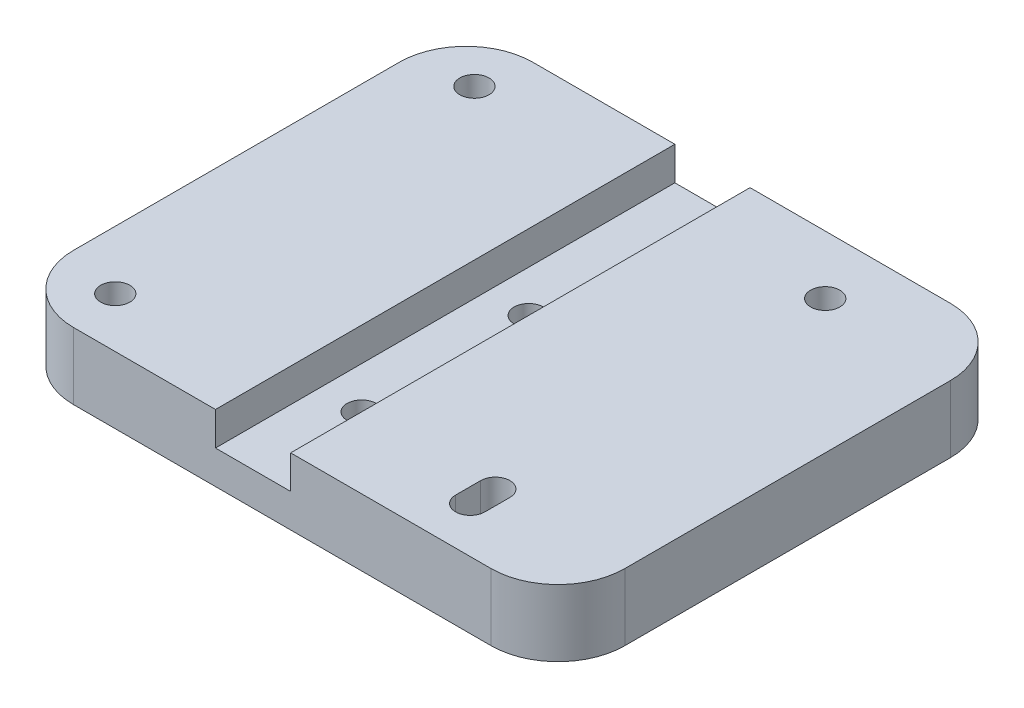
ISO-10303-21;
HEADER;
FILE_DESCRIPTION(('STEP AP214'),'2;1');
FILE_NAME('part.step','',(''),(''),'','','');
FILE_SCHEMA(('AUTOMOTIVE_DESIGN { 1 0 10303 214 1 1 1 1 }'));
ENDSEC;
DATA;
#1=APPLICATION_CONTEXT('core data for automotive mechanical design processes');
#2=APPLICATION_PROTOCOL_DEFINITION('international standard','automotive_design',2000,#1);
#3=PRODUCT_CONTEXT('',#1,'mechanical');
#4=PRODUCT('Part','Part','',(#3));
#5=PRODUCT_RELATED_PRODUCT_CATEGORY('part','',(#4));
#6=PRODUCT_DEFINITION_FORMATION('','',#4);
#7=PRODUCT_DEFINITION_CONTEXT('part definition',#1,'design');
#8=PRODUCT_DEFINITION('design','',#6,#7);
#9=PRODUCT_DEFINITION_SHAPE('','',#8);
#10=(LENGTH_UNIT() NAMED_UNIT(*) SI_UNIT(.MILLI.,.METRE.));
#11=(NAMED_UNIT(*) PLANE_ANGLE_UNIT() SI_UNIT($,.RADIAN.));
#12=(NAMED_UNIT(*) SI_UNIT($,.STERADIAN.) SOLID_ANGLE_UNIT());
#13=UNCERTAINTY_MEASURE_WITH_UNIT(LENGTH_MEASURE(1.E-05),#10,'distance_accuracy_value','');
#14=(GEOMETRIC_REPRESENTATION_CONTEXT(3) GLOBAL_UNCERTAINTY_ASSIGNED_CONTEXT((#13)) GLOBAL_UNIT_ASSIGNED_CONTEXT((#10,
#11,#12)) REPRESENTATION_CONTEXT('',''));
#15=CARTESIAN_POINT('',(0.,0.,0.));
#16=DIRECTION('',(0.,0.,1.));
#17=DIRECTION('',(1.,0.,0.));
#18=AXIS2_PLACEMENT_3D('',#15,#16,#17);
#19=CARTESIAN_POINT('',(50.,4.,49.5));
#20=DIRECTION('',(0.,-1.,0.));
#21=DIRECTION('',(0.,0.,-1.));
#22=AXIS2_PLACEMENT_3D('',#19,#20,#21);
#23=CYLINDRICAL_SURFACE('',#22,1.75);
#24=CARTESIAN_POINT('',(50.,4.,49.5));
#25=DIRECTION('',(0.,-1.,0.));
#26=DIRECTION('',(0.,0.,-1.));
#27=AXIS2_PLACEMENT_3D('',#24,#25,#26);
#28=CIRCLE('',#27,1.75);
#29=CARTESIAN_POINT('',(48.25,4.,49.5));
#30=VERTEX_POINT('',#29);
#31=CARTESIAN_POINT('',(51.75,4.,49.5));
#32=VERTEX_POINT('',#31);
#33=EDGE_CURVE('E222',#30,#32,#28,.F.);
#34=ORIENTED_EDGE('',*,*,#33,.F.);
#35=DIRECTION('',(0.,-1.,0.));
#36=VECTOR('',#35,1.);
#37=CARTESIAN_POINT('',(48.25,4.,49.5));
#38=LINE('',#37,#36);
#39=CARTESIAN_POINT('',(48.25,8.,49.5));
#40=VERTEX_POINT('',#39);
#41=EDGE_CURVE('E306',#40,#30,#38,.T.);
#42=ORIENTED_EDGE('',*,*,#41,.F.);
#43=CARTESIAN_POINT('',(50.,8.,49.5));
#44=DIRECTION('',(0.,1.,0.));
#45=DIRECTION('',(-1.,0.,0.));
#46=AXIS2_PLACEMENT_3D('',#43,#44,#45);
#47=CIRCLE('',#46,1.75);
#48=CARTESIAN_POINT('',(51.75,8.,49.5));
#49=VERTEX_POINT('',#48);
#50=EDGE_CURVE('E258',#40,#49,#47,.T.);
#51=ORIENTED_EDGE('',*,*,#50,.T.);
#52=DIRECTION('',(0.,-1.,0.));
#53=VECTOR('',#52,1.);
#54=CARTESIAN_POINT('',(51.75,4.,49.5));
#55=LINE('',#54,#53);
#56=EDGE_CURVE('E296',#49,#32,#55,.T.);
#57=ORIENTED_EDGE('',*,*,#56,.T.);
#58=EDGE_LOOP('',(#34,#42,#51,#57));
#59=FACE_BOUND('',#58,.T.);
#60=ADVANCED_FACE('F33',(#59),#23,.F.);
#61=CARTESIAN_POINT('',(51.75,4.,49.5));
#62=DIRECTION('',(1.,0.,0.));
#63=DIRECTION('',(0.,0.,-1.));
#64=AXIS2_PLACEMENT_3D('',#61,#62,#63);
#65=PLANE('',#64);
#66=DIRECTION('',(0.,0.,-1.));
#67=VECTOR('',#66,1.);
#68=CARTESIAN_POINT('',(51.75,4.,49.5));
#69=LINE('',#68,#67);
#70=CARTESIAN_POINT('',(51.75,4.,46.5));
#71=VERTEX_POINT('',#70);
#72=EDGE_CURVE('E219',#32,#71,#69,.T.);
#73=ORIENTED_EDGE('',*,*,#72,.F.);
#74=ORIENTED_EDGE('',*,*,#56,.F.);
#75=DIRECTION('',(0.,0.,-1.));
#76=VECTOR('',#75,1.);
#77=CARTESIAN_POINT('',(51.75,8.,46.5));
#78=LINE('',#77,#76);
#79=CARTESIAN_POINT('',(51.75,8.,46.5));
#80=VERTEX_POINT('',#79);
#81=EDGE_CURVE('E261',#49,#80,#78,.T.);
#82=ORIENTED_EDGE('',*,*,#81,.T.);
#83=DIRECTION('',(0.,-1.,0.));
#84=VECTOR('',#83,1.);
#85=CARTESIAN_POINT('',(51.75,4.,46.5));
#86=LINE('',#85,#84);
#87=EDGE_CURVE('E300',#80,#71,#86,.T.);
#88=ORIENTED_EDGE('',*,*,#87,.T.);
#89=EDGE_LOOP('',(#73,#74,#82,#88));
#90=FACE_BOUND('',#89,.T.);
#91=ADVANCED_FACE('F445',(#90),#65,.F.);
#92=CARTESIAN_POINT('',(50.,4.,46.5));
#93=DIRECTION('',(0.,-1.,0.));
#94=DIRECTION('',(0.,0.,-1.));
#95=AXIS2_PLACEMENT_3D('',#92,#93,#94);
#96=CYLINDRICAL_SURFACE('',#95,1.75);
#97=CARTESIAN_POINT('',(50.,4.,46.5));
#98=DIRECTION('',(0.,-1.,0.));
#99=DIRECTION('',(0.,0.,-1.));
#100=AXIS2_PLACEMENT_3D('',#97,#98,#99);
#101=CIRCLE('',#100,1.75);
#102=CARTESIAN_POINT('',(48.25,4.,46.5));
#103=VERTEX_POINT('',#102);
#104=EDGE_CURVE('E217',#71,#103,#101,.F.);
#105=ORIENTED_EDGE('',*,*,#104,.F.);
#106=ORIENTED_EDGE('',*,*,#87,.F.);
#107=CARTESIAN_POINT('',(50.,8.,46.5));
#108=DIRECTION('',(0.,1.,0.));
#109=DIRECTION('',(-1.,0.,0.));
#110=AXIS2_PLACEMENT_3D('',#107,#108,#109);
#111=CIRCLE('',#110,1.75);
#112=CARTESIAN_POINT('',(48.25,7.99999999999999,46.5));
#113=VERTEX_POINT('',#112);
#114=EDGE_CURVE('E264',#80,#113,#111,.T.);
#115=ORIENTED_EDGE('',*,*,#114,.T.);
#116=DIRECTION('',(0.,-1.,0.));
#117=VECTOR('',#116,1.);
#118=CARTESIAN_POINT('',(48.25,4.,46.5));
#119=LINE('',#118,#117);
#120=EDGE_CURVE('E303',#113,#103,#119,.T.);
#121=ORIENTED_EDGE('',*,*,#120,.T.);
#122=EDGE_LOOP('',(#105,#106,#115,#121));
#123=FACE_BOUND('',#122,.T.);
#124=ADVANCED_FACE('F450',(#123),#96,.F.);
#125=CARTESIAN_POINT('',(48.25,4.,49.5));
#126=DIRECTION('',(-1.,0.,0.));
#127=DIRECTION('',(0.,0.,1.));
#128=AXIS2_PLACEMENT_3D('',#125,#126,#127);
#129=PLANE('',#128);
#130=DIRECTION('',(0.,0.,1.));
#131=VECTOR('',#130,1.);
#132=CARTESIAN_POINT('',(48.25,4.,49.5));
#133=LINE('',#132,#131);
#134=EDGE_CURVE('E327',#103,#30,#133,.T.);
#135=ORIENTED_EDGE('',*,*,#134,.F.);
#136=ORIENTED_EDGE('',*,*,#120,.F.);
#137=DIRECTION('',(0.,0.,1.));
#138=VECTOR('',#137,1.);
#139=CARTESIAN_POINT('',(48.25,8.,49.5));
#140=LINE('',#139,#138);
#141=EDGE_CURVE('E267',#113,#40,#140,.T.);
#142=ORIENTED_EDGE('',*,*,#141,.T.);
#143=ORIENTED_EDGE('',*,*,#41,.T.);
#144=EDGE_LOOP('',(#135,#136,#142,#143));
#145=FACE_BOUND('',#144,.T.);
#146=ADVANCED_FACE('F455',(#145),#129,.F.);
#147=CARTESIAN_POINT('',(7.,4.,49.));
#148=DIRECTION('',(0.,-1.,0.));
#149=DIRECTION('',(0.,0.,-1.));
#150=AXIS2_PLACEMENT_3D('',#147,#148,#149);
#151=CYLINDRICAL_SURFACE('',#150,1.75000000000001);
#152=CARTESIAN_POINT('',(7.,8.,49.));
#153=DIRECTION('',(0.,1.,0.));
#154=DIRECTION('',(-1.,0.,0.));
#155=AXIS2_PLACEMENT_3D('',#152,#153,#154);
#156=CIRCLE('',#155,1.75000000000001);
#157=CARTESIAN_POINT('',(5.24999999999999,8.,49.));
#158=VERTEX_POINT('',#157);
#159=EDGE_CURVE('E234',#158,#158,#156,.T.);
#160=ORIENTED_EDGE('',*,*,#159,.T.);
#161=EDGE_LOOP('',(#160));
#162=FACE_BOUND('',#161,.T.);
#163=CARTESIAN_POINT('',(7.,4.,49.));
#164=DIRECTION('',(0.,-1.,0.));
#165=DIRECTION('',(0.,0.,-1.));
#166=AXIS2_PLACEMENT_3D('',#163,#164,#165);
#167=CIRCLE('',#166,1.75000000000001);
#168=CARTESIAN_POINT('',(7.,4.,47.25));
#169=VERTEX_POINT('',#168);
#170=EDGE_CURVE('E220',#169,#169,#167,.F.);
#171=ORIENTED_EDGE('',*,*,#170,.F.);
#172=EDGE_LOOP('',(#171));
#173=FACE_BOUND('',#172,.T.);
#174=ADVANCED_FACE('F458',(#162,#173),#151,.F.);
#175=CARTESIAN_POINT('',(7.,4.,6.));
#176=DIRECTION('',(0.,-1.,0.));
#177=DIRECTION('',(0.,0.,-1.));
#178=AXIS2_PLACEMENT_3D('',#175,#176,#177);
#179=CYLINDRICAL_SURFACE('',#178,1.75);
#180=CARTESIAN_POINT('',(7.,8.,6.));
#181=DIRECTION('',(0.,1.,0.));
#182=DIRECTION('',(-1.,0.,0.));
#183=AXIS2_PLACEMENT_3D('',#180,#181,#182);
#184=CIRCLE('',#183,1.75);
#185=CARTESIAN_POINT('',(5.24999999999999,8.,6.));
#186=VERTEX_POINT('',#185);
#187=EDGE_CURVE('E231',#186,#186,#184,.T.);
#188=ORIENTED_EDGE('',*,*,#187,.T.);
#189=EDGE_LOOP('',(#188));
#190=FACE_BOUND('',#189,.T.);
#191=CARTESIAN_POINT('',(7.,4.,6.));
#192=DIRECTION('',(0.,-1.,0.));
#193=DIRECTION('',(0.,0.,-1.));
#194=AXIS2_PLACEMENT_3D('',#191,#192,#193);
#195=CIRCLE('',#194,1.75);
#196=CARTESIAN_POINT('',(7.,4.,4.25));
#197=VERTEX_POINT('',#196);
#198=EDGE_CURVE('E330',#197,#197,#195,.F.);
#199=ORIENTED_EDGE('',*,*,#198,.F.);
#200=EDGE_LOOP('',(#199));
#201=FACE_BOUND('',#200,.T.);
#202=ADVANCED_FACE('F463',(#190,#201),#179,.F.);
#203=CARTESIAN_POINT('',(50.,4.,7.));
#204=DIRECTION('',(0.,-1.,0.));
#205=DIRECTION('',(0.,0.,-1.));
#206=AXIS2_PLACEMENT_3D('',#203,#204,#205);
#207=CYLINDRICAL_SURFACE('',#206,1.75);
#208=CARTESIAN_POINT('',(50.,8.,7.));
#209=DIRECTION('',(0.,1.,0.));
#210=DIRECTION('',(-1.,0.,0.));
#211=AXIS2_PLACEMENT_3D('',#208,#209,#210);
#212=CIRCLE('',#211,1.75);
#213=CARTESIAN_POINT('',(48.25,8.,7.));
#214=VERTEX_POINT('',#213);
#215=EDGE_CURVE('E255',#214,#214,#212,.T.);
#216=ORIENTED_EDGE('',*,*,#215,.T.);
#217=EDGE_LOOP('',(#216));
#218=FACE_BOUND('',#217,.T.);
#219=CARTESIAN_POINT('',(50.,4.,7.));
#220=DIRECTION('',(0.,-1.,0.));
#221=DIRECTION('',(0.,0.,-1.));
#222=AXIS2_PLACEMENT_3D('',#219,#220,#221);
#223=CIRCLE('',#222,1.75);
#224=CARTESIAN_POINT('',(50.,4.,5.25));
#225=VERTEX_POINT('',#224);
#226=EDGE_CURVE('E228',#225,#225,#223,.F.);
#227=ORIENTED_EDGE('',*,*,#226,.F.);
#228=EDGE_LOOP('',(#227));
#229=FACE_BOUND('',#228,.T.);
#230=ADVANCED_FACE('F466',(#218,#229),#207,.F.);
#231=CARTESIAN_POINT('',(75.,3.99999999999999,55.));
#232=DIRECTION('',(0.,-1.,0.));
#233=DIRECTION('',(1.,0.,0.));
#234=AXIS2_PLACEMENT_3D('',#231,#232,#233);
#235=PLANE('',#234);
#236=CARTESIAN_POINT('',(30.,4.,42.5));
#237=DIRECTION('',(0.,-1.,0.));
#238=DIRECTION('',(0.,0.,1.));
#239=AXIS2_PLACEMENT_3D('',#236,#237,#238);
#240=CIRCLE('',#239,1.75);
#241=CARTESIAN_POINT('',(30.,4.,44.25));
#242=VERTEX_POINT('',#241);
#243=EDGE_CURVE('E290',#242,#242,#240,.T.);
#244=ORIENTED_EDGE('',*,*,#243,.T.);
#245=EDGE_LOOP('',(#244));
#246=FACE_BOUND('',#245,.T.);
#247=CARTESIAN_POINT('',(30.,4.,22.5));
#248=DIRECTION('',(0.,-1.,0.));
#249=DIRECTION('',(0.,0.,1.));
#250=AXIS2_PLACEMENT_3D('',#247,#248,#249);
#251=CIRCLE('',#250,1.75000000000001);
#252=CARTESIAN_POINT('',(30.,4.,24.25));
#253=VERTEX_POINT('',#252);
#254=EDGE_CURVE('E309',#253,#253,#251,.T.);
#255=ORIENTED_EDGE('',*,*,#254,.T.);
#256=EDGE_LOOP('',(#255));
#257=FACE_BOUND('',#256,.T.);
#258=DIRECTION('',(0.,0.,-1.));
#259=VECTOR('',#258,1.);
#260=CARTESIAN_POINT('',(25.,4.,55.));
#261=LINE('',#260,#259);
#262=CARTESIAN_POINT('',(25.,4.,55.));
#263=VERTEX_POINT('',#262);
#264=CARTESIAN_POINT('',(25.,4.,0.));
#265=VERTEX_POINT('',#264);
#266=EDGE_CURVE('E237',#263,#265,#261,.T.);
#267=ORIENTED_EDGE('',*,*,#266,.F.);
#268=DIRECTION('',(-1.,0.,0.));
#269=VECTOR('',#268,1.);
#270=CARTESIAN_POINT('',(75.,3.99999999999999,55.));
#271=LINE('',#270,#269);
#272=CARTESIAN_POINT('',(34.,4.,55.));
#273=VERTEX_POINT('',#272);
#274=EDGE_CURVE('E317',#273,#263,#271,.T.);
#275=ORIENTED_EDGE('',*,*,#274,.F.);
#276=DIRECTION('',(0.,0.,1.));
#277=VECTOR('',#276,1.);
#278=CARTESIAN_POINT('',(34.,4.,55.));
#279=LINE('',#278,#277);
#280=CARTESIAN_POINT('',(34.,4.,0.));
#281=VERTEX_POINT('',#280);
#282=EDGE_CURVE('E270',#281,#273,#279,.T.);
#283=ORIENTED_EDGE('',*,*,#282,.F.);
#284=DIRECTION('',(-1.,0.,0.));
#285=VECTOR('',#284,1.);
#286=CARTESIAN_POINT('',(75.,3.99999999999999,0.));
#287=LINE('',#286,#285);
#288=EDGE_CURVE('E318',#281,#265,#287,.T.);
#289=ORIENTED_EDGE('',*,*,#288,.T.);
#290=EDGE_LOOP('',(#267,#275,#283,#289));
#291=FACE_BOUND('',#290,.T.);
#292=ADVANCED_FACE('F688',(#246,#257,#291),#235,.F.);
#293=CARTESIAN_POINT('',(0.,0.,55.));
#294=DIRECTION('',(1.,0.,0.));
#295=DIRECTION('',(0.,0.,-1.));
#296=AXIS2_PLACEMENT_3D('',#293,#294,#295);
#297=PLANE('',#296);
#298=DIRECTION('',(0.,0.,1.));
#299=VECTOR('',#298,1.);
#300=CARTESIAN_POINT('',(0.,8.,55.));
#301=LINE('',#300,#299);
#302=CARTESIAN_POINT('',(0.,8.,8.));
#303=VERTEX_POINT('',#302);
#304=CARTESIAN_POINT('',(0.,8.,47.));
#305=VERTEX_POINT('',#304);
#306=EDGE_CURVE('E243',#303,#305,#301,.T.);
#307=ORIENTED_EDGE('',*,*,#306,.F.);
#308=DIRECTION('',(0.,-1.,0.));
#309=VECTOR('',#308,1.);
#310=CARTESIAN_POINT('',(0.,0.,8.));
#311=LINE('',#310,#309);
#312=CARTESIAN_POINT('',(0.,0.,8.));
#313=VERTEX_POINT('',#312);
#314=EDGE_CURVE('E365',#303,#313,#311,.T.);
#315=ORIENTED_EDGE('',*,*,#314,.T.);
#316=DIRECTION('',(0.,0.,-1.));
#317=VECTOR('',#316,1.);
#318=CARTESIAN_POINT('',(0.,0.,55.));
#319=LINE('',#318,#317);
#320=CARTESIAN_POINT('',(0.,0.,47.));
#321=VERTEX_POINT('',#320);
#322=EDGE_CURVE('E321',#321,#313,#319,.T.);
#323=ORIENTED_EDGE('',*,*,#322,.F.);
#324=DIRECTION('',(0.,-1.,0.));
#325=VECTOR('',#324,1.);
#326=CARTESIAN_POINT('',(0.,8.,47.));
#327=LINE('',#326,#325);
#328=EDGE_CURVE('E48',#321,#305,#327,.F.);
#329=ORIENTED_EDGE('',*,*,#328,.T.);
#330=EDGE_LOOP('',(#307,#315,#323,#329));
#331=FACE_BOUND('',#330,.T.);
#332=ADVANCED_FACE('F380',(#331),#297,.F.);
#333=CARTESIAN_POINT('',(0.,0.,55.));
#334=DIRECTION('',(0.,1.,0.));
#335=DIRECTION('',(0.,0.,1.));
#336=AXIS2_PLACEMENT_3D('',#333,#334,#335);
#337=PLANE('',#336);
#338=CARTESIAN_POINT('',(7.,0.,6.));
#339=DIRECTION('',(0.,-1.,0.));
#340=DIRECTION('',(0.,0.,-1.));
#341=AXIS2_PLACEMENT_3D('',#338,#339,#340);
#342=CIRCLE('',#341,4.);
#343=CARTESIAN_POINT('',(7.,0.,2.));
#344=VERTEX_POINT('',#343);
#345=EDGE_CURVE('E405',#344,#344,#342,.T.);
#346=ORIENTED_EDGE('',*,*,#345,.F.);
#347=EDGE_LOOP('',(#346));
#348=FACE_BOUND('',#347,.T.);
#349=CARTESIAN_POINT('',(7.,0.,49.));
#350=DIRECTION('',(0.,-1.,0.));
#351=DIRECTION('',(0.,0.,-1.));
#352=AXIS2_PLACEMENT_3D('',#349,#350,#351);
#353=CIRCLE('',#352,4.00000000000001);
#354=CARTESIAN_POINT('',(7.,0.,45.));
#355=VERTEX_POINT('',#354);
#356=EDGE_CURVE('E201',#355,#355,#353,.T.);
#357=ORIENTED_EDGE('',*,*,#356,.F.);
#358=EDGE_LOOP('',(#357));
#359=FACE_BOUND('',#358,.T.);
#360=DIRECTION('',(0.,0.,1.));
#361=VECTOR('',#360,1.);
#362=CARTESIAN_POINT('',(54.,0.,46.5));
#363=LINE('',#362,#361);
#364=CARTESIAN_POINT('',(54.,0.,46.5));
#365=VERTEX_POINT('',#364);
#366=CARTESIAN_POINT('',(54.,0.,49.5));
#367=VERTEX_POINT('',#366);
#368=EDGE_CURVE('E207',#365,#367,#363,.T.);
#369=ORIENTED_EDGE('',*,*,#368,.F.);
#370=CARTESIAN_POINT('',(50.,0.,46.5));
#371=DIRECTION('',(0.,-1.,0.));
#372=DIRECTION('',(0.,0.,-1.));
#373=AXIS2_PLACEMENT_3D('',#370,#371,#372);
#374=CIRCLE('',#373,4.);
#375=CARTESIAN_POINT('',(46.,0.,46.5));
#376=VERTEX_POINT('',#375);
#377=EDGE_CURVE('E177',#376,#365,#374,.T.);
#378=ORIENTED_EDGE('',*,*,#377,.F.);
#379=DIRECTION('',(0.,0.,-1.));
#380=VECTOR('',#379,1.);
#381=CARTESIAN_POINT('',(46.,0.,46.5));
#382=LINE('',#381,#380);
#383=CARTESIAN_POINT('',(46.,0.,49.5));
#384=VERTEX_POINT('',#383);
#385=EDGE_CURVE('E195',#384,#376,#382,.T.);
#386=ORIENTED_EDGE('',*,*,#385,.F.);
#387=CARTESIAN_POINT('',(50.,0.,49.5));
#388=DIRECTION('',(0.,-1.,0.));
#389=DIRECTION('',(0.,0.,-1.));
#390=AXIS2_PLACEMENT_3D('',#387,#388,#389);
#391=CIRCLE('',#390,4.);
#392=EDGE_CURVE('E198',#367,#384,#391,.T.);
#393=ORIENTED_EDGE('',*,*,#392,.F.);
#394=EDGE_LOOP('',(#369,#378,#386,#393));
#395=FACE_BOUND('',#394,.T.);
#396=CARTESIAN_POINT('',(50.,0.,7.));
#397=DIRECTION('',(0.,-1.,0.));
#398=DIRECTION('',(0.,0.,-1.));
#399=AXIS2_PLACEMENT_3D('',#396,#397,#398);
#400=CIRCLE('',#399,4.00000000000001);
#401=CARTESIAN_POINT('',(50.,0.,2.99999999999999));
#402=VERTEX_POINT('',#401);
#403=EDGE_CURVE('E224',#402,#402,#400,.T.);
#404=ORIENTED_EDGE('',*,*,#403,.F.);
#405=EDGE_LOOP('',(#404));
#406=FACE_BOUND('',#405,.T.);
#407=CARTESIAN_POINT('',(30.,0.,42.5));
#408=DIRECTION('',(0.,-1.,0.));
#409=DIRECTION('',(0.,0.,1.));
#410=AXIS2_PLACEMENT_3D('',#407,#408,#409);
#411=CIRCLE('',#410,1.75);
#412=CARTESIAN_POINT('',(30.,0.,44.25));
#413=VERTEX_POINT('',#412);
#414=EDGE_CURVE('E289',#413,#413,#411,.T.);
#415=ORIENTED_EDGE('',*,*,#414,.F.);
#416=EDGE_LOOP('',(#415));
#417=FACE_BOUND('',#416,.T.);
#418=CARTESIAN_POINT('',(30.,0.,22.5));
#419=DIRECTION('',(0.,-1.,0.));
#420=DIRECTION('',(0.,0.,1.));
#421=AXIS2_PLACEMENT_3D('',#418,#419,#420);
#422=CIRCLE('',#421,1.75000000000001);
#423=CARTESIAN_POINT('',(30.,0.,24.25));
#424=VERTEX_POINT('',#423);
#425=EDGE_CURVE('E293',#424,#424,#422,.T.);
#426=ORIENTED_EDGE('',*,*,#425,.F.);
#427=EDGE_LOOP('',(#426));
#428=FACE_BOUND('',#427,.T.);
#429=DIRECTION('',(1.,0.,0.));
#430=VECTOR('',#429,1.);
#431=CARTESIAN_POINT('',(0.,0.,0.));
#432=LINE('',#431,#430);
#433=CARTESIAN_POINT('',(8.,0.,0.));
#434=VERTEX_POINT('',#433);
#435=CARTESIAN_POINT('',(58.,0.,0.));
#436=VERTEX_POINT('',#435);
#437=EDGE_CURVE('E299',#434,#436,#432,.T.);
#438=ORIENTED_EDGE('',*,*,#437,.T.);
#439=CARTESIAN_POINT('',(58.,0.,8.));
#440=DIRECTION('',(0.,1.,0.));
#441=DIRECTION('',(0.,0.,1.));
#442=AXIS2_PLACEMENT_3D('',#439,#440,#441);
#443=CIRCLE('',#442,8.);
#444=CARTESIAN_POINT('',(66.,0.,8.));
#445=VERTEX_POINT('',#444);
#446=EDGE_CURVE('E348',#436,#445,#443,.F.);
#447=ORIENTED_EDGE('',*,*,#446,.T.);
#448=DIRECTION('',(0.,0.,1.));
#449=VECTOR('',#448,1.);
#450=CARTESIAN_POINT('',(66.,0.,55.));
#451=LINE('',#450,#449);
#452=CARTESIAN_POINT('',(66.,0.,47.));
#453=VERTEX_POINT('',#452);
#454=EDGE_CURVE('E208',#445,#453,#451,.T.);
#455=ORIENTED_EDGE('',*,*,#454,.T.);
#456=CARTESIAN_POINT('',(58.,0.,47.));
#457=DIRECTION('',(0.,1.,0.));
#458=DIRECTION('',(0.,0.,1.));
#459=AXIS2_PLACEMENT_3D('',#456,#457,#458);
#460=CIRCLE('',#459,8.);
#461=CARTESIAN_POINT('',(58.,0.,55.));
#462=VERTEX_POINT('',#461);
#463=EDGE_CURVE('E346',#453,#462,#460,.F.);
#464=ORIENTED_EDGE('',*,*,#463,.T.);
#465=DIRECTION('',(1.,0.,0.));
#466=VECTOR('',#465,1.);
#467=CARTESIAN_POINT('',(0.,0.,55.));
#468=LINE('',#467,#466);
#469=CARTESIAN_POINT('',(8.,0.,55.));
#470=VERTEX_POINT('',#469);
#471=EDGE_CURVE('E314',#470,#462,#468,.T.);
#472=ORIENTED_EDGE('',*,*,#471,.F.);
#473=CARTESIAN_POINT('',(8.,0.,47.));
#474=DIRECTION('',(0.,1.,0.));
#475=DIRECTION('',(0.,0.,1.));
#476=AXIS2_PLACEMENT_3D('',#473,#474,#475);
#477=CIRCLE('',#476,8.);
#478=EDGE_CURVE('E342',#470,#321,#477,.F.);
#479=ORIENTED_EDGE('',*,*,#478,.T.);
#480=ORIENTED_EDGE('',*,*,#322,.T.);
#481=CARTESIAN_POINT('',(8.,0.,8.));
#482=DIRECTION('',(0.,1.,0.));
#483=DIRECTION('',(0.,0.,1.));
#484=AXIS2_PLACEMENT_3D('',#481,#482,#483);
#485=CIRCLE('',#484,8.);
#486=EDGE_CURVE('E344',#313,#434,#485,.F.);
#487=ORIENTED_EDGE('',*,*,#486,.T.);
#488=EDGE_LOOP('',(#438,#447,#455,#464,#472,#479,#480,#487));
#489=FACE_BOUND('',#488,.T.);
#490=ADVANCED_FACE('F379',(#348,#359,#395,#406,#417,#428,#489),#337,.F.);
#491=CARTESIAN_POINT('',(0.,0.,55.));
#492=DIRECTION('',(0.,0.,1.));
#493=DIRECTION('',(1.,0.,0.));
#494=AXIS2_PLACEMENT_3D('',#491,#492,#493);
#495=PLANE('',#494);
#496=ORIENTED_EDGE('',*,*,#471,.T.);
#497=DIRECTION('',(0.,-1.,0.));
#498=VECTOR('',#497,1.);
#499=CARTESIAN_POINT('',(58.,7.99999999999999,55.));
#500=LINE('',#499,#498);
#501=CARTESIAN_POINT('',(58.,7.99999999999999,55.));
#502=VERTEX_POINT('',#501);
#503=EDGE_CURVE('E362',#462,#502,#500,.F.);
#504=ORIENTED_EDGE('',*,*,#503,.T.);
#505=DIRECTION('',(1.,0.,0.));
#506=VECTOR('',#505,1.);
#507=CARTESIAN_POINT('',(66.,7.99999999999999,55.));
#508=LINE('',#507,#506);
#509=CARTESIAN_POINT('',(34.,8.,55.));
#510=VERTEX_POINT('',#509);
#511=EDGE_CURVE('E278',#510,#502,#508,.T.);
#512=ORIENTED_EDGE('',*,*,#511,.F.);
#513=DIRECTION('',(0.,-1.,0.));
#514=VECTOR('',#513,1.);
#515=CARTESIAN_POINT('',(34.,8.,55.));
#516=LINE('',#515,#514);
#517=EDGE_CURVE('E281',#510,#273,#516,.T.);
#518=ORIENTED_EDGE('',*,*,#517,.T.);
#519=ORIENTED_EDGE('',*,*,#274,.T.);
#520=DIRECTION('',(0.,-1.,0.));
#521=VECTOR('',#520,1.);
#522=CARTESIAN_POINT('',(25.,8.,55.));
#523=LINE('',#522,#521);
#524=CARTESIAN_POINT('',(25.,8.,55.));
#525=VERTEX_POINT('',#524);
#526=EDGE_CURVE('E247',#525,#263,#523,.T.);
#527=ORIENTED_EDGE('',*,*,#526,.F.);
#528=DIRECTION('',(1.,0.,0.));
#529=VECTOR('',#528,1.);
#530=CARTESIAN_POINT('',(25.,8.,55.));
#531=LINE('',#530,#529);
#532=CARTESIAN_POINT('',(8.,8.,55.));
#533=VERTEX_POINT('',#532);
#534=EDGE_CURVE('E245',#533,#525,#531,.T.);
#535=ORIENTED_EDGE('',*,*,#534,.F.);
#536=DIRECTION('',(0.,-1.,0.));
#537=VECTOR('',#536,1.);
#538=CARTESIAN_POINT('',(8.,0.,55.));
#539=LINE('',#538,#537);
#540=EDGE_CURVE('E359',#533,#470,#539,.T.);
#541=ORIENTED_EDGE('',*,*,#540,.T.);
#542=EDGE_LOOP('',(#496,#504,#512,#518,#519,#527,#535,#541));
#543=FACE_BOUND('',#542,.T.);
#544=ADVANCED_FACE('F375',(#543),#495,.T.);
#545=CARTESIAN_POINT('',(0.,0.,0.));
#546=DIRECTION('',(0.,0.,1.));
#547=DIRECTION('',(1.,0.,0.));
#548=AXIS2_PLACEMENT_3D('',#545,#546,#547);
#549=PLANE('',#548);
#550=DIRECTION('',(-1.,0.,0.));
#551=VECTOR('',#550,1.);
#552=CARTESIAN_POINT('',(66.,7.99999999999999,0.));
#553=LINE('',#552,#551);
#554=CARTESIAN_POINT('',(58.,7.99999999999999,0.));
#555=VERTEX_POINT('',#554);
#556=CARTESIAN_POINT('',(34.,8.,0.));
#557=VERTEX_POINT('',#556);
#558=EDGE_CURVE('E274',#555,#557,#553,.T.);
#559=ORIENTED_EDGE('',*,*,#558,.F.);
#560=DIRECTION('',(0.,-1.,0.));
#561=VECTOR('',#560,1.);
#562=CARTESIAN_POINT('',(58.,0.,0.));
#563=LINE('',#562,#561);
#564=EDGE_CURVE('E339',#555,#436,#563,.T.);
#565=ORIENTED_EDGE('',*,*,#564,.T.);
#566=ORIENTED_EDGE('',*,*,#437,.F.);
#567=DIRECTION('',(0.,-1.,0.));
#568=VECTOR('',#567,1.);
#569=CARTESIAN_POINT('',(8.,0.,0.));
#570=LINE('',#569,#568);
#571=CARTESIAN_POINT('',(8.,8.,0.));
#572=VERTEX_POINT('',#571);
#573=EDGE_CURVE('E337',#434,#572,#570,.F.);
#574=ORIENTED_EDGE('',*,*,#573,.T.);
#575=DIRECTION('',(-1.,0.,0.));
#576=VECTOR('',#575,1.);
#577=CARTESIAN_POINT('',(25.,8.,0.));
#578=LINE('',#577,#576);
#579=CARTESIAN_POINT('',(25.,8.,0.));
#580=VERTEX_POINT('',#579);
#581=EDGE_CURVE('E241',#580,#572,#578,.T.);
#582=ORIENTED_EDGE('',*,*,#581,.F.);
#583=DIRECTION('',(0.,-1.,0.));
#584=VECTOR('',#583,1.);
#585=CARTESIAN_POINT('',(25.,8.,0.));
#586=LINE('',#585,#584);
#587=EDGE_CURVE('E252',#580,#265,#586,.T.);
#588=ORIENTED_EDGE('',*,*,#587,.T.);
#589=ORIENTED_EDGE('',*,*,#288,.F.);
#590=DIRECTION('',(0.,-1.,0.));
#591=VECTOR('',#590,1.);
#592=CARTESIAN_POINT('',(34.,8.,0.));
#593=LINE('',#592,#591);
#594=EDGE_CURVE('E286',#557,#281,#593,.T.);
#595=ORIENTED_EDGE('',*,*,#594,.F.);
#596=EDGE_LOOP('',(#559,#565,#566,#574,#582,#588,#589,#595));
#597=FACE_BOUND('',#596,.T.);
#598=ADVANCED_FACE('F388',(#597),#549,.F.);
#599=CARTESIAN_POINT('',(30.,4.,22.5));
#600=DIRECTION('',(0.,-1.,0.));
#601=DIRECTION('',(0.,0.,-1.));
#602=AXIS2_PLACEMENT_3D('',#599,#600,#601);
#603=CYLINDRICAL_SURFACE('',#602,1.75000000000001);
#604=ORIENTED_EDGE('',*,*,#254,.F.);
#605=EDGE_LOOP('',(#604));
#606=FACE_BOUND('',#605,.T.);
#607=ORIENTED_EDGE('',*,*,#425,.T.);
#608=EDGE_LOOP('',(#607));
#609=FACE_BOUND('',#608,.T.);
#610=ADVANCED_FACE('F428',(#606,#609),#603,.F.);
#611=CARTESIAN_POINT('',(30.,4.,42.5));
#612=DIRECTION('',(0.,-1.,0.));
#613=DIRECTION('',(0.,0.,-1.));
#614=AXIS2_PLACEMENT_3D('',#611,#612,#613);
#615=CYLINDRICAL_SURFACE('',#614,1.75);
#616=ORIENTED_EDGE('',*,*,#243,.F.);
#617=EDGE_LOOP('',(#616));
#618=FACE_BOUND('',#617,.T.);
#619=ORIENTED_EDGE('',*,*,#414,.T.);
#620=EDGE_LOOP('',(#619));
#621=FACE_BOUND('',#620,.T.);
#622=ADVANCED_FACE('F430',(#618,#621),#615,.F.);
#623=CARTESIAN_POINT('',(0.,8.,0.));
#624=DIRECTION('',(0.,1.,0.));
#625=DIRECTION('',(-1.,0.,0.));
#626=AXIS2_PLACEMENT_3D('',#623,#624,#625);
#627=PLANE('',#626);
#628=ORIENTED_EDGE('',*,*,#81,.F.);
#629=ORIENTED_EDGE('',*,*,#50,.F.);
#630=ORIENTED_EDGE('',*,*,#141,.F.);
#631=ORIENTED_EDGE('',*,*,#114,.F.);
#632=EDGE_LOOP('',(#628,#629,#630,#631));
#633=FACE_BOUND('',#632,.T.);
#634=DIRECTION('',(0.,0.,-1.));
#635=VECTOR('',#634,1.);
#636=CARTESIAN_POINT('',(66.,7.99999999999999,55.));
#637=LINE('',#636,#635);
#638=CARTESIAN_POINT('',(66.,7.99999999999999,47.));
#639=VERTEX_POINT('',#638);
#640=CARTESIAN_POINT('',(66.,7.99999999999999,8.));
#641=VERTEX_POINT('',#640);
#642=EDGE_CURVE('E271',#639,#641,#637,.T.);
#643=ORIENTED_EDGE('',*,*,#642,.T.);
#644=CARTESIAN_POINT('',(58.,7.99999999999999,8.));
#645=DIRECTION('',(0.,1.,0.));
#646=DIRECTION('',(-1.,0.,0.));
#647=AXIS2_PLACEMENT_3D('',#644,#645,#646);
#648=CIRCLE('',#647,8.);
#649=EDGE_CURVE('E357',#641,#555,#648,.T.);
#650=ORIENTED_EDGE('',*,*,#649,.T.);
#651=ORIENTED_EDGE('',*,*,#558,.T.);
#652=DIRECTION('',(0.,0.,1.));
#653=VECTOR('',#652,1.);
#654=CARTESIAN_POINT('',(34.,8.,55.));
#655=LINE('',#654,#653);
#656=EDGE_CURVE('E276',#557,#510,#655,.T.);
#657=ORIENTED_EDGE('',*,*,#656,.T.);
#658=ORIENTED_EDGE('',*,*,#511,.T.);
#659=CARTESIAN_POINT('',(58.,7.99999999999999,47.));
#660=DIRECTION('',(0.,1.,0.));
#661=DIRECTION('',(-1.,0.,0.));
#662=AXIS2_PLACEMENT_3D('',#659,#660,#661);
#663=CIRCLE('',#662,8.);
#664=EDGE_CURVE('E355',#502,#639,#663,.T.);
#665=ORIENTED_EDGE('',*,*,#664,.T.);
#666=EDGE_LOOP('',(#643,#650,#651,#657,#658,#665));
#667=FACE_BOUND('',#666,.T.);
#668=ORIENTED_EDGE('',*,*,#215,.F.);
#669=EDGE_LOOP('',(#668));
#670=FACE_BOUND('',#669,.T.);
#671=ADVANCED_FACE('F437',(#633,#667,#670),#627,.T.);
#672=CARTESIAN_POINT('',(66.,7.99999999999999,55.));
#673=DIRECTION('',(-1.,0.,0.));
#674=DIRECTION('',(0.,0.,1.));
#675=AXIS2_PLACEMENT_3D('',#672,#673,#674);
#676=PLANE('',#675);
#677=ORIENTED_EDGE('',*,*,#454,.F.);
#678=DIRECTION('',(0.,-1.,0.));
#679=VECTOR('',#678,1.);
#680=CARTESIAN_POINT('',(66.,7.99999999999999,8.));
#681=LINE('',#680,#679);
#682=EDGE_CURVE('E353',#445,#641,#681,.F.);
#683=ORIENTED_EDGE('',*,*,#682,.T.);
#684=ORIENTED_EDGE('',*,*,#642,.F.);
#685=DIRECTION('',(0.,-1.,0.));
#686=VECTOR('',#685,1.);
#687=CARTESIAN_POINT('',(66.,0.,47.));
#688=LINE('',#687,#686);
#689=EDGE_CURVE('E350',#639,#453,#688,.T.);
#690=ORIENTED_EDGE('',*,*,#689,.T.);
#691=EDGE_LOOP('',(#677,#683,#684,#690));
#692=FACE_BOUND('',#691,.T.);
#693=ADVANCED_FACE('F398',(#692),#676,.F.);
#694=CARTESIAN_POINT('',(34.,8.,55.));
#695=DIRECTION('',(1.,0.,0.));
#696=DIRECTION('',(0.,1.,0.));
#697=AXIS2_PLACEMENT_3D('',#694,#695,#696);
#698=PLANE('',#697);
#699=ORIENTED_EDGE('',*,*,#282,.T.);
#700=ORIENTED_EDGE('',*,*,#517,.F.);
#701=ORIENTED_EDGE('',*,*,#656,.F.);
#702=ORIENTED_EDGE('',*,*,#594,.T.);
#703=EDGE_LOOP('',(#699,#700,#701,#702));
#704=FACE_BOUND('',#703,.T.);
#705=ADVANCED_FACE('F473',(#704),#698,.F.);
#706=CARTESIAN_POINT('',(0.,8.,0.));
#707=DIRECTION('',(0.,1.,0.));
#708=DIRECTION('',(-1.,0.,0.));
#709=AXIS2_PLACEMENT_3D('',#706,#707,#708);
#710=PLANE('',#709);
#711=ORIENTED_EDGE('',*,*,#159,.F.);
#712=EDGE_LOOP('',(#711));
#713=FACE_BOUND('',#712,.T.);
#714=ORIENTED_EDGE('',*,*,#581,.T.);
#715=CARTESIAN_POINT('',(8.,8.,8.));
#716=DIRECTION('',(0.,1.,0.));
#717=DIRECTION('',(-1.,0.,0.));
#718=AXIS2_PLACEMENT_3D('',#715,#716,#717);
#719=CIRCLE('',#718,8.);
#720=EDGE_CURVE('E11',#572,#303,#719,.T.);
#721=ORIENTED_EDGE('',*,*,#720,.T.);
#722=ORIENTED_EDGE('',*,*,#306,.T.);
#723=CARTESIAN_POINT('',(8.,8.,47.));
#724=DIRECTION('',(0.,1.,0.));
#725=DIRECTION('',(-1.,0.,0.));
#726=AXIS2_PLACEMENT_3D('',#723,#724,#725);
#727=CIRCLE('',#726,8.);
#728=EDGE_CURVE('E41',#305,#533,#727,.T.);
#729=ORIENTED_EDGE('',*,*,#728,.T.);
#730=ORIENTED_EDGE('',*,*,#534,.T.);
#731=DIRECTION('',(0.,0.,-1.));
#732=VECTOR('',#731,1.);
#733=CARTESIAN_POINT('',(25.,8.,55.));
#734=LINE('',#733,#732);
#735=EDGE_CURVE('E238',#525,#580,#734,.T.);
#736=ORIENTED_EDGE('',*,*,#735,.T.);
#737=EDGE_LOOP('',(#714,#721,#722,#729,#730,#736));
#738=FACE_BOUND('',#737,.T.);
#739=ORIENTED_EDGE('',*,*,#187,.F.);
#740=EDGE_LOOP('',(#739));
#741=FACE_BOUND('',#740,.T.);
#742=ADVANCED_FACE('F369',(#713,#738,#741),#710,.T.);
#743=CARTESIAN_POINT('',(25.,8.,55.));
#744=DIRECTION('',(-1.,0.,0.));
#745=DIRECTION('',(0.,-1.,0.));
#746=AXIS2_PLACEMENT_3D('',#743,#744,#745);
#747=PLANE('',#746);
#748=ORIENTED_EDGE('',*,*,#266,.T.);
#749=ORIENTED_EDGE('',*,*,#587,.F.);
#750=ORIENTED_EDGE('',*,*,#735,.F.);
#751=ORIENTED_EDGE('',*,*,#526,.T.);
#752=EDGE_LOOP('',(#748,#749,#750,#751));
#753=FACE_BOUND('',#752,.T.);
#754=ADVANCED_FACE('F480',(#753),#747,.F.);
#755=CARTESIAN_POINT('',(50.,4.,7.));
#756=DIRECTION('',(0.,-1.,0.));
#757=DIRECTION('',(0.,0.,-1.));
#758=AXIS2_PLACEMENT_3D('',#755,#756,#757);
#759=PLANE('',#758);
#760=CARTESIAN_POINT('',(50.,4.,7.));
#761=DIRECTION('',(0.,-1.,0.));
#762=DIRECTION('',(0.,0.,-1.));
#763=AXIS2_PLACEMENT_3D('',#760,#761,#762);
#764=CIRCLE('',#763,4.00000000000001);
#765=CARTESIAN_POINT('',(50.,4.,2.99999999999999));
#766=VERTEX_POINT('',#765);
#767=EDGE_CURVE('E225',#766,#766,#764,.T.);
#768=ORIENTED_EDGE('',*,*,#767,.T.);
#769=EDGE_LOOP('',(#768));
#770=FACE_BOUND('',#769,.T.);
#771=ORIENTED_EDGE('',*,*,#226,.T.);
#772=EDGE_LOOP('',(#771));
#773=FACE_BOUND('',#772,.T.);
#774=ADVANCED_FACE('F483',(#770,#773),#759,.T.);
#775=CARTESIAN_POINT('',(50.,4.,7.));
#776=DIRECTION('',(0.,-1.,0.));
#777=DIRECTION('',(0.,0.,-1.));
#778=AXIS2_PLACEMENT_3D('',#775,#776,#777);
#779=CYLINDRICAL_SURFACE('',#778,4.00000000000001);
#780=ORIENTED_EDGE('',*,*,#767,.F.);
#781=EDGE_LOOP('',(#780));
#782=FACE_BOUND('',#781,.T.);
#783=ORIENTED_EDGE('',*,*,#403,.T.);
#784=EDGE_LOOP('',(#783));
#785=FACE_BOUND('',#784,.T.);
#786=ADVANCED_FACE('F488',(#782,#785),#779,.F.);
#787=CARTESIAN_POINT('',(7.,4.,6.));
#788=DIRECTION('',(0.,-1.,0.));
#789=DIRECTION('',(0.,0.,-1.));
#790=AXIS2_PLACEMENT_3D('',#787,#788,#789);
#791=PLANE('',#790);
#792=CARTESIAN_POINT('',(7.,4.,6.));
#793=DIRECTION('',(0.,-1.,0.));
#794=DIRECTION('',(0.,0.,-1.));
#795=AXIS2_PLACEMENT_3D('',#792,#793,#794);
#796=CIRCLE('',#795,4.);
#797=CARTESIAN_POINT('',(7.,4.,2.));
#798=VERTEX_POINT('',#797);
#799=EDGE_CURVE('E333',#798,#798,#796,.T.);
#800=ORIENTED_EDGE('',*,*,#799,.T.);
#801=EDGE_LOOP('',(#800));
#802=FACE_BOUND('',#801,.T.);
#803=ORIENTED_EDGE('',*,*,#198,.T.);
#804=EDGE_LOOP('',(#803));
#805=FACE_BOUND('',#804,.T.);
#806=ADVANCED_FACE('F491',(#802,#805),#791,.T.);
#807=CARTESIAN_POINT('',(7.,4.,6.));
#808=DIRECTION('',(0.,-1.,0.));
#809=DIRECTION('',(0.,0.,-1.));
#810=AXIS2_PLACEMENT_3D('',#807,#808,#809);
#811=CYLINDRICAL_SURFACE('',#810,4.);
#812=ORIENTED_EDGE('',*,*,#799,.F.);
#813=EDGE_LOOP('',(#812));
#814=FACE_BOUND('',#813,.T.);
#815=ORIENTED_EDGE('',*,*,#345,.T.);
#816=EDGE_LOOP('',(#815));
#817=FACE_BOUND('',#816,.T.);
#818=ADVANCED_FACE('F516',(#814,#817),#811,.F.);
#819=CARTESIAN_POINT('',(7.,4.,49.));
#820=DIRECTION('',(0.,-1.,0.));
#821=DIRECTION('',(0.,0.,-1.));
#822=AXIS2_PLACEMENT_3D('',#819,#820,#821);
#823=PLANE('',#822);
#824=CARTESIAN_POINT('',(7.,4.,49.));
#825=DIRECTION('',(0.,-1.,0.));
#826=DIRECTION('',(0.,0.,-1.));
#827=AXIS2_PLACEMENT_3D('',#824,#825,#826);
#828=CIRCLE('',#827,4.00000000000001);
#829=CARTESIAN_POINT('',(7.,4.,45.));
#830=VERTEX_POINT('',#829);
#831=EDGE_CURVE('E407',#830,#830,#828,.T.);
#832=ORIENTED_EDGE('',*,*,#831,.T.);
#833=EDGE_LOOP('',(#832));
#834=FACE_BOUND('',#833,.T.);
#835=ORIENTED_EDGE('',*,*,#170,.T.);
#836=EDGE_LOOP('',(#835));
#837=FACE_BOUND('',#836,.T.);
#838=ADVANCED_FACE('F512',(#834,#837),#823,.T.);
#839=CARTESIAN_POINT('',(7.,4.,49.));
#840=DIRECTION('',(0.,-1.,0.));
#841=DIRECTION('',(0.,0.,-1.));
#842=AXIS2_PLACEMENT_3D('',#839,#840,#841);
#843=CYLINDRICAL_SURFACE('',#842,4.00000000000001);
#844=ORIENTED_EDGE('',*,*,#831,.F.);
#845=EDGE_LOOP('',(#844));
#846=FACE_BOUND('',#845,.T.);
#847=ORIENTED_EDGE('',*,*,#356,.T.);
#848=EDGE_LOOP('',(#847));
#849=FACE_BOUND('',#848,.T.);
#850=ADVANCED_FACE('F414',(#846,#849),#843,.F.);
#851=CARTESIAN_POINT('',(50.,4.,46.5));
#852=DIRECTION('',(0.,-1.,0.));
#853=DIRECTION('',(0.,0.,-1.));
#854=AXIS2_PLACEMENT_3D('',#851,#852,#853);
#855=PLANE('',#854);
#856=CARTESIAN_POINT('',(50.,4.,46.5));
#857=DIRECTION('',(0.,-1.,0.));
#858=DIRECTION('',(0.,0.,-1.));
#859=AXIS2_PLACEMENT_3D('',#856,#857,#858);
#860=CIRCLE('',#859,4.);
#861=CARTESIAN_POINT('',(46.,4.,46.5));
#862=VERTEX_POINT('',#861);
#863=CARTESIAN_POINT('',(54.,4.,46.5));
#864=VERTEX_POINT('',#863);
#865=EDGE_CURVE('E174',#862,#864,#860,.T.);
#866=ORIENTED_EDGE('',*,*,#865,.T.);
#867=DIRECTION('',(0.,0.,1.));
#868=VECTOR('',#867,1.);
#869=CARTESIAN_POINT('',(54.,4.,46.5));
#870=LINE('',#869,#868);
#871=CARTESIAN_POINT('',(54.,4.,49.5));
#872=VERTEX_POINT('',#871);
#873=EDGE_CURVE('E185',#864,#872,#870,.T.);
#874=ORIENTED_EDGE('',*,*,#873,.T.);
#875=CARTESIAN_POINT('',(50.,4.,49.5));
#876=DIRECTION('',(0.,-1.,0.));
#877=DIRECTION('',(0.,0.,-1.));
#878=AXIS2_PLACEMENT_3D('',#875,#876,#877);
#879=CIRCLE('',#878,4.);
#880=CARTESIAN_POINT('',(46.,4.,49.5));
#881=VERTEX_POINT('',#880);
#882=EDGE_CURVE('E190',#872,#881,#879,.T.);
#883=ORIENTED_EDGE('',*,*,#882,.T.);
#884=DIRECTION('',(0.,0.,-1.));
#885=VECTOR('',#884,1.);
#886=CARTESIAN_POINT('',(46.,4.,46.5));
#887=LINE('',#886,#885);
#888=EDGE_CURVE('E182',#881,#862,#887,.T.);
#889=ORIENTED_EDGE('',*,*,#888,.T.);
#890=EDGE_LOOP('',(#866,#874,#883,#889));
#891=FACE_BOUND('',#890,.T.);
#892=ORIENTED_EDGE('',*,*,#33,.T.);
#893=ORIENTED_EDGE('',*,*,#72,.T.);
#894=ORIENTED_EDGE('',*,*,#104,.T.);
#895=ORIENTED_EDGE('',*,*,#134,.T.);
#896=EDGE_LOOP('',(#892,#893,#894,#895));
#897=FACE_BOUND('',#896,.T.);
#898=ADVANCED_FACE('F192',(#891,#897),#855,.T.);
#899=CARTESIAN_POINT('',(50.,4.,46.5));
#900=DIRECTION('',(0.,-1.,0.));
#901=DIRECTION('',(0.,0.,-1.));
#902=AXIS2_PLACEMENT_3D('',#899,#900,#901);
#903=CYLINDRICAL_SURFACE('',#902,4.);
#904=ORIENTED_EDGE('',*,*,#377,.T.);
#905=DIRECTION('',(0.,-1.,0.));
#906=VECTOR('',#905,1.);
#907=CARTESIAN_POINT('',(54.,4.,46.5));
#908=LINE('',#907,#906);
#909=EDGE_CURVE('E170',#864,#365,#908,.T.);
#910=ORIENTED_EDGE('',*,*,#909,.F.);
#911=ORIENTED_EDGE('',*,*,#865,.F.);
#912=DIRECTION('',(0.,-1.,0.));
#913=VECTOR('',#912,1.);
#914=CARTESIAN_POINT('',(46.,4.,46.5));
#915=LINE('',#914,#913);
#916=EDGE_CURVE('E212',#862,#376,#915,.T.);
#917=ORIENTED_EDGE('',*,*,#916,.T.);
#918=EDGE_LOOP('',(#904,#910,#911,#917));
#919=FACE_BOUND('',#918,.T.);
#920=ADVANCED_FACE('F172',(#919),#903,.F.);
#921=CARTESIAN_POINT('',(46.,4.,46.5));
#922=DIRECTION('',(-1.,0.,0.));
#923=DIRECTION('',(0.,0.,1.));
#924=AXIS2_PLACEMENT_3D('',#921,#922,#923);
#925=PLANE('',#924);
#926=ORIENTED_EDGE('',*,*,#385,.T.);
#927=ORIENTED_EDGE('',*,*,#916,.F.);
#928=ORIENTED_EDGE('',*,*,#888,.F.);
#929=DIRECTION('',(0.,-1.,0.));
#930=VECTOR('',#929,1.);
#931=CARTESIAN_POINT('',(46.,4.,49.5));
#932=LINE('',#931,#930);
#933=EDGE_CURVE('E214',#881,#384,#932,.T.);
#934=ORIENTED_EDGE('',*,*,#933,.T.);
#935=EDGE_LOOP('',(#926,#927,#928,#934));
#936=FACE_BOUND('',#935,.T.);
#937=ADVANCED_FACE('F498',(#936),#925,.F.);
#938=CARTESIAN_POINT('',(50.,4.,49.5));
#939=DIRECTION('',(0.,-1.,0.));
#940=DIRECTION('',(0.,0.,-1.));
#941=AXIS2_PLACEMENT_3D('',#938,#939,#940);
#942=CYLINDRICAL_SURFACE('',#941,4.);
#943=ORIENTED_EDGE('',*,*,#392,.T.);
#944=ORIENTED_EDGE('',*,*,#933,.F.);
#945=ORIENTED_EDGE('',*,*,#882,.F.);
#946=DIRECTION('',(0.,-1.,0.));
#947=VECTOR('',#946,1.);
#948=CARTESIAN_POINT('',(54.,4.,49.5));
#949=LINE('',#948,#947);
#950=EDGE_CURVE('E181',#872,#367,#949,.T.);
#951=ORIENTED_EDGE('',*,*,#950,.T.);
#952=EDGE_LOOP('',(#943,#944,#945,#951));
#953=FACE_BOUND('',#952,.T.);
#954=ADVANCED_FACE('F501',(#953),#942,.F.);
#955=CARTESIAN_POINT('',(54.,4.,46.5));
#956=DIRECTION('',(1.,0.,0.));
#957=DIRECTION('',(0.,0.,-1.));
#958=AXIS2_PLACEMENT_3D('',#955,#956,#957);
#959=PLANE('',#958);
#960=ORIENTED_EDGE('',*,*,#368,.T.);
#961=ORIENTED_EDGE('',*,*,#950,.F.);
#962=ORIENTED_EDGE('',*,*,#873,.F.);
#963=ORIENTED_EDGE('',*,*,#909,.T.);
#964=EDGE_LOOP('',(#960,#961,#962,#963));
#965=FACE_BOUND('',#964,.T.);
#966=ADVANCED_FACE('F186',(#965),#959,.F.);
#967=CARTESIAN_POINT('',(58.,0.,8.));
#968=DIRECTION('',(0.,-1.,0.));
#969=DIRECTION('',(1.,0.,0.));
#970=AXIS2_PLACEMENT_3D('',#967,#968,#969);
#971=CYLINDRICAL_SURFACE('',#970,8.);
#972=ORIENTED_EDGE('',*,*,#649,.F.);
#973=ORIENTED_EDGE('',*,*,#682,.F.);
#974=ORIENTED_EDGE('',*,*,#446,.F.);
#975=ORIENTED_EDGE('',*,*,#564,.F.);
#976=EDGE_LOOP('',(#972,#973,#974,#975));
#977=FACE_BOUND('',#976,.T.);
#978=ADVANCED_FACE('F393',(#977),#971,.T.);
#979=CARTESIAN_POINT('',(58.,7.99999999999999,47.));
#980=DIRECTION('',(0.,1.,0.));
#981=DIRECTION('',(-1.,0.,0.));
#982=AXIS2_PLACEMENT_3D('',#979,#980,#981);
#983=CYLINDRICAL_SURFACE('',#982,8.);
#984=ORIENTED_EDGE('',*,*,#664,.F.);
#985=ORIENTED_EDGE('',*,*,#503,.F.);
#986=ORIENTED_EDGE('',*,*,#463,.F.);
#987=ORIENTED_EDGE('',*,*,#689,.F.);
#988=EDGE_LOOP('',(#984,#985,#986,#987));
#989=FACE_BOUND('',#988,.T.);
#990=ADVANCED_FACE('F571',(#989),#983,.T.);
#991=CARTESIAN_POINT('',(8.,0.,8.));
#992=DIRECTION('',(0.,-1.,0.));
#993=DIRECTION('',(0.,0.,-1.));
#994=AXIS2_PLACEMENT_3D('',#991,#992,#993);
#995=CYLINDRICAL_SURFACE('',#994,8.);
#996=ORIENTED_EDGE('',*,*,#720,.F.);
#997=ORIENTED_EDGE('',*,*,#573,.F.);
#998=ORIENTED_EDGE('',*,*,#486,.F.);
#999=ORIENTED_EDGE('',*,*,#314,.F.);
#1000=EDGE_LOOP('',(#996,#997,#998,#999));
#1001=FACE_BOUND('',#1000,.T.);
#1002=ADVANCED_FACE('F383',(#1001),#995,.T.);
#1003=CARTESIAN_POINT('',(8.,0.,47.));
#1004=DIRECTION('',(0.,1.,0.));
#1005=DIRECTION('',(0.,0.,1.));
#1006=AXIS2_PLACEMENT_3D('',#1003,#1004,#1005);
#1007=CYLINDRICAL_SURFACE('',#1006,8.);
#1008=ORIENTED_EDGE('',*,*,#728,.F.);
#1009=ORIENTED_EDGE('',*,*,#328,.F.);
#1010=ORIENTED_EDGE('',*,*,#478,.F.);
#1011=ORIENTED_EDGE('',*,*,#540,.F.);
#1012=EDGE_LOOP('',(#1008,#1009,#1010,#1011));
#1013=FACE_BOUND('',#1012,.T.);
#1014=ADVANCED_FACE('F35',(#1013),#1007,.T.);
#1015=CLOSED_SHELL('',(#60,#91,#124,#146,#174,#202,#230,#292,#332,#490,#544,#598,#610,#622,#671,
#693,#705,#742,#754,#774,#786,#806,#818,#838,#850,#898,#920,#937,#954,#966,#978,#990,#1002,#1014));
#1016=MANIFOLD_SOLID_BREP('B2',#1015);
#1017=ADVANCED_BREP_SHAPE_REPRESENTATION('',(#18,#1016),#14);
#1018=SHAPE_DEFINITION_REPRESENTATION(#9,#1017);
ENDSEC;
END-ISO-10303-21;
